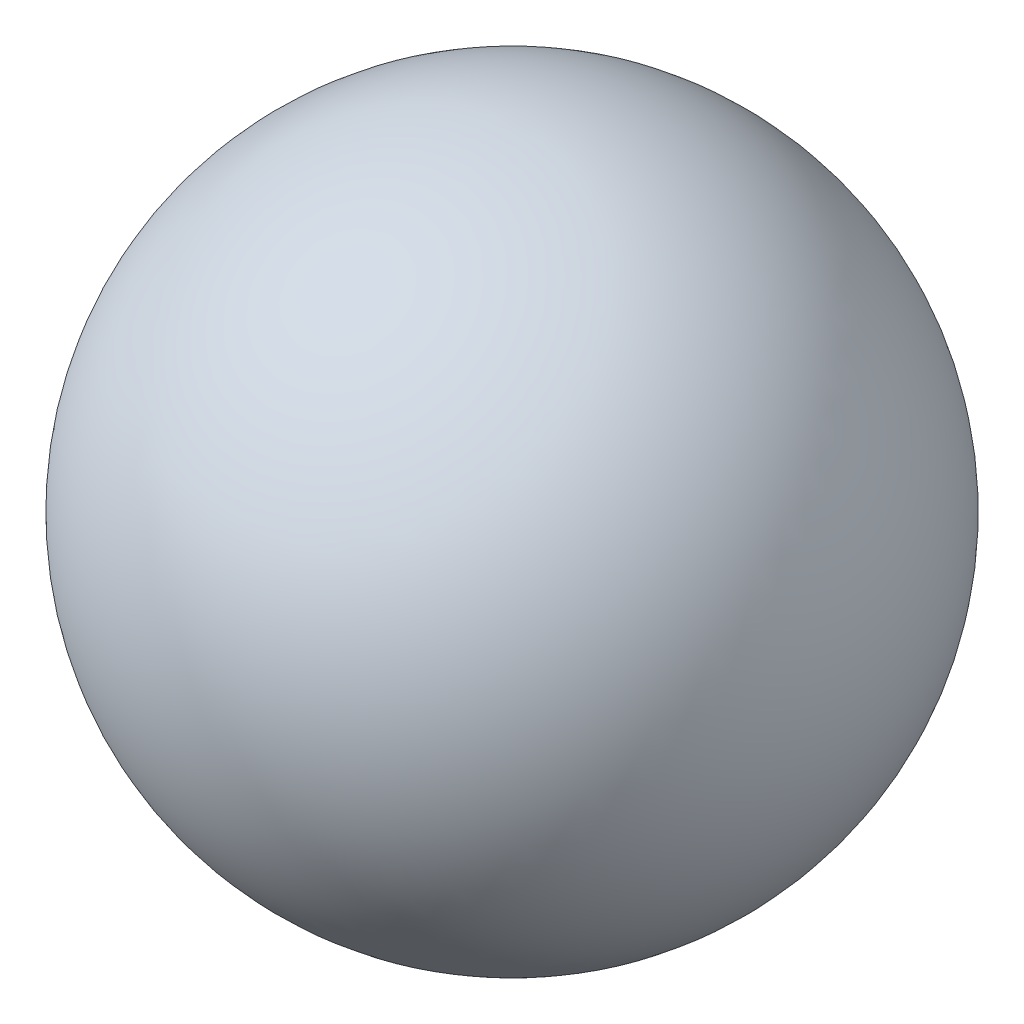
ISO-10303-21;
HEADER;
FILE_DESCRIPTION(('STEP AP214'),'2;1');
FILE_NAME('part.step','',(''),(''),'','','');
FILE_SCHEMA(('AUTOMOTIVE_DESIGN { 1 0 10303 214 1 1 1 1 }'));
ENDSEC;
DATA;
#1=APPLICATION_CONTEXT('core data for automotive mechanical design processes');
#2=APPLICATION_PROTOCOL_DEFINITION('international standard','automotive_design',2000,#1);
#3=PRODUCT_CONTEXT('',#1,'mechanical');
#4=PRODUCT('Part','Part','',(#3));
#5=PRODUCT_RELATED_PRODUCT_CATEGORY('part','',(#4));
#6=PRODUCT_DEFINITION_FORMATION('','',#4);
#7=PRODUCT_DEFINITION_CONTEXT('part definition',#1,'design');
#8=PRODUCT_DEFINITION('design','',#6,#7);
#9=PRODUCT_DEFINITION_SHAPE('','',#8);
#10=(LENGTH_UNIT() NAMED_UNIT(*) SI_UNIT(.MILLI.,.METRE.));
#11=(NAMED_UNIT(*) PLANE_ANGLE_UNIT() SI_UNIT($,.RADIAN.));
#12=(NAMED_UNIT(*) SI_UNIT($,.STERADIAN.) SOLID_ANGLE_UNIT());
#13=UNCERTAINTY_MEASURE_WITH_UNIT(LENGTH_MEASURE(1.E-05),#10,'distance_accuracy_value','');
#14=(GEOMETRIC_REPRESENTATION_CONTEXT(3) GLOBAL_UNCERTAINTY_ASSIGNED_CONTEXT((#13)) GLOBAL_UNIT_ASSIGNED_CONTEXT((#10,
#11,#12)) REPRESENTATION_CONTEXT('',''));
#15=CARTESIAN_POINT('',(0.,0.,0.));
#16=DIRECTION('',(0.,0.,1.));
#17=DIRECTION('',(1.,0.,0.));
#18=AXIS2_PLACEMENT_3D('',#15,#16,#17);
#19=CARTESIAN_POINT('',(0.,0.,0.));
#20=DIRECTION('',(0.,1.,0.));
#21=DIRECTION('',(1.,0.,0.));
#22=AXIS2_PLACEMENT_3D('',#19,#20,#21);
#23=SPHERICAL_SURFACE('',#22,33.5);
#24=CARTESIAN_POINT('',(0.,33.5,0.));
#25=VERTEX_POINT('',#24);
#26=VERTEX_LOOP('',#25);
#27=FACE_BOUND('',#26,.T.);
#28=ADVANCED_FACE('F33',(#27),#23,.T.);
#29=CLOSED_SHELL('',(#28));
#30=MANIFOLD_SOLID_BREP('B2',#29);
#31=ADVANCED_BREP_SHAPE_REPRESENTATION('',(#18,#30),#14);
#32=SHAPE_DEFINITION_REPRESENTATION(#9,#31);
ENDSEC;
END-ISO-10303-21;
